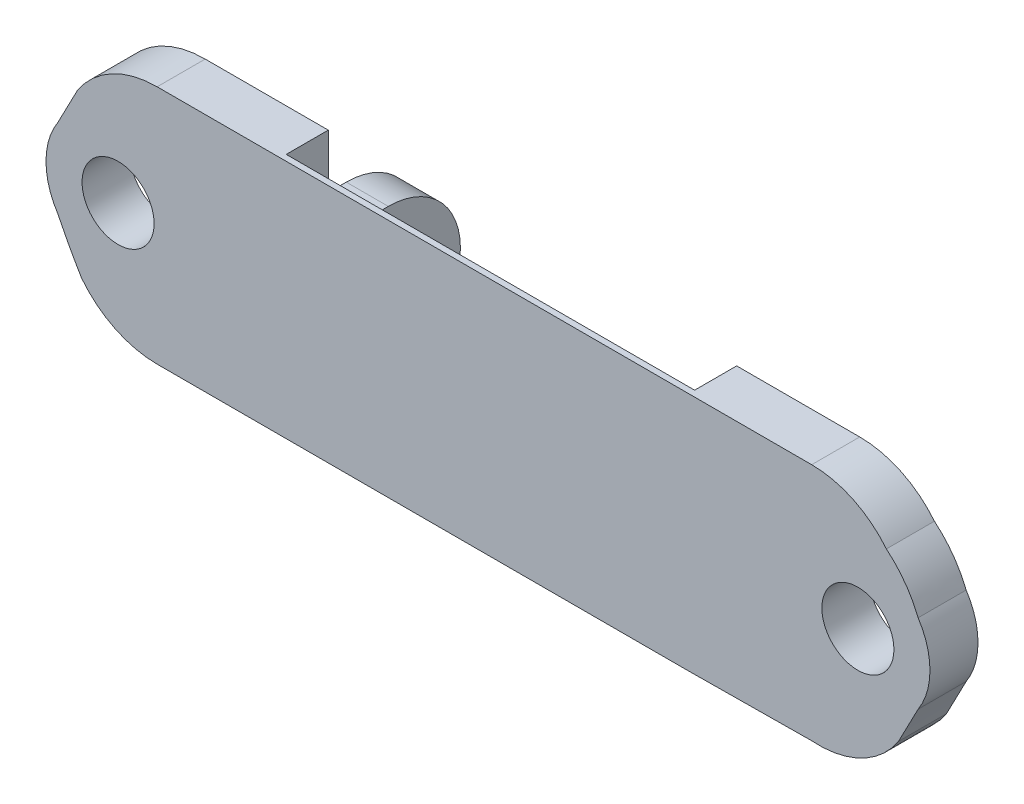
ISO-10303-21;
HEADER;
FILE_DESCRIPTION(('STEP AP214'),'2;1');
FILE_NAME('part.step','',(''),(''),'','','');
FILE_SCHEMA(('AUTOMOTIVE_DESIGN { 1 0 10303 214 1 1 1 1 }'));
ENDSEC;
DATA;
#1=APPLICATION_CONTEXT('core data for automotive mechanical design processes');
#2=APPLICATION_PROTOCOL_DEFINITION('international standard','automotive_design',2000,#1);
#3=PRODUCT_CONTEXT('',#1,'mechanical');
#4=PRODUCT('Part','Part','',(#3));
#5=PRODUCT_RELATED_PRODUCT_CATEGORY('part','',(#4));
#6=PRODUCT_DEFINITION_FORMATION('','',#4);
#7=PRODUCT_DEFINITION_CONTEXT('part definition',#1,'design');
#8=PRODUCT_DEFINITION('design','',#6,#7);
#9=PRODUCT_DEFINITION_SHAPE('','',#8);
#10=(LENGTH_UNIT() NAMED_UNIT(*) SI_UNIT(.MILLI.,.METRE.));
#11=(NAMED_UNIT(*) PLANE_ANGLE_UNIT() SI_UNIT($,.RADIAN.));
#12=(NAMED_UNIT(*) SI_UNIT($,.STERADIAN.) SOLID_ANGLE_UNIT());
#13=UNCERTAINTY_MEASURE_WITH_UNIT(LENGTH_MEASURE(1.E-05),#10,'distance_accuracy_value','');
#14=(GEOMETRIC_REPRESENTATION_CONTEXT(3) GLOBAL_UNCERTAINTY_ASSIGNED_CONTEXT((#13)) GLOBAL_UNIT_ASSIGNED_CONTEXT((#10,
#11,#12)) REPRESENTATION_CONTEXT('',''));
#15=CARTESIAN_POINT('',(0.,0.,0.));
#16=DIRECTION('',(0.,0.,1.));
#17=DIRECTION('',(1.,0.,0.));
#18=AXIS2_PLACEMENT_3D('',#15,#16,#17);
#19=CARTESIAN_POINT('',(-16.9999933862145,0.,4.));
#20=DIRECTION('',(1.,0.,0.));
#21=DIRECTION('',(0.,1.,0.));
#22=AXIS2_PLACEMENT_3D('',#19,#20,#21);
#23=PLANE('',#22);
#24=CARTESIAN_POINT('',(-16.9999933862145,-3.99999931575757,-6.00000102816619));
#25=DIRECTION('',(1.,0.,0.));
#26=DIRECTION('',(0.,0.,-1.));
#27=AXIS2_PLACEMENT_3D('',#24,#25,#26);
#28=CIRCLE('',#27,2.59999897183381);
#29=CARTESIAN_POINT('',(-16.9999933862145,-3.99999931575757,-8.6));
#30=VERTEX_POINT('',#29);
#31=EDGE_CURVE('E483',#30,#30,#28,.T.);
#32=ORIENTED_EDGE('',*,*,#31,.F.);
#33=EDGE_LOOP('',(#32));
#34=FACE_BOUND('',#33,.T.);
#35=DIRECTION('',(0.,-0.992631533391881,-0.121171939474797));
#36=VECTOR('',#35,1.);
#37=CARTESIAN_POINT('',(-16.9999933862145,-0.274222707120713,2.24641206074548));
#38=LINE('',#37,#36);
#39=CARTESIAN_POINT('',(-16.9999933862145,9.99999998281392,3.500601));
#40=VERTEX_POINT('',#39);
#41=CARTESIAN_POINT('',(-16.9999933862145,-2.29281201718889,1.99999999999999));
#42=VERTEX_POINT('',#41);
#43=EDGE_CURVE('E504',#40,#42,#38,.T.);
#44=ORIENTED_EDGE('',*,*,#43,.T.);
#45=DIRECTION('',(0.,-1.,0.));
#46=VECTOR('',#45,1.);
#47=CARTESIAN_POINT('',(-16.9999933862145,0.,1.99999999999999));
#48=LINE('',#47,#46);
#49=CARTESIAN_POINT('',(-16.9999933862145,-10.0000000171888,1.99999999999999));
#50=VERTEX_POINT('',#49);
#51=EDGE_CURVE('E284',#42,#50,#48,.T.);
#52=ORIENTED_EDGE('',*,*,#51,.T.);
#53=DIRECTION('',(0.,0.,-1.));
#54=VECTOR('',#53,1.);
#55=CARTESIAN_POINT('',(-16.9999933862145,-10.0000000171888,4.));
#56=LINE('',#55,#54);
#57=CARTESIAN_POINT('',(-16.9999933862145,-10.0000000171888,-4.99999929856876));
#58=VERTEX_POINT('',#57);
#59=EDGE_CURVE('E523',#50,#58,#56,.T.);
#60=ORIENTED_EDGE('',*,*,#59,.T.);
#61=CARTESIAN_POINT('',(-16.9999933862145,-3.99999931575757,-4.99999929856876));
#62=DIRECTION('',(1.,0.,0.));
#63=DIRECTION('',(0.,0.,-1.));
#64=AXIS2_PLACEMENT_3D('',#61,#62,#63);
#65=CIRCLE('',#64,6.00000070143124);
#66=CARTESIAN_POINT('',(-16.9999933862145,2.00000138567367,-4.99999929856876));
#67=VERTEX_POINT('',#66);
#68=EDGE_CURVE('E418',#58,#67,#65,.T.);
#69=ORIENTED_EDGE('',*,*,#68,.T.);
#70=DIRECTION('',(0.,0.,-1.));
#71=VECTOR('',#70,1.);
#72=CARTESIAN_POINT('',(-16.9999933862145,2.00000138567367,0.));
#73=LINE('',#72,#71);
#74=CARTESIAN_POINT('',(-16.9999933862145,2.00000138567367,0.));
#75=VERTEX_POINT('',#74);
#76=EDGE_CURVE('E413',#75,#67,#73,.T.);
#77=ORIENTED_EDGE('',*,*,#76,.F.);
#78=DIRECTION('',(0.,-1.,0.));
#79=VECTOR('',#78,1.);
#80=CARTESIAN_POINT('',(-16.9999933862145,0.,0.));
#81=LINE('',#80,#79);
#82=CARTESIAN_POINT('',(-16.9999933862145,9.99999998281392,0.));
#83=VERTEX_POINT('',#82);
#84=EDGE_CURVE('E394',#83,#75,#81,.T.);
#85=ORIENTED_EDGE('',*,*,#84,.F.);
#86=DIRECTION('',(0.,0.,-1.));
#87=VECTOR('',#86,1.);
#88=CARTESIAN_POINT('',(-16.9999933862145,9.99999998281392,4.));
#89=LINE('',#88,#87);
#90=EDGE_CURVE('E526',#40,#83,#89,.T.);
#91=ORIENTED_EDGE('',*,*,#90,.F.);
#92=EDGE_LOOP('',(#44,#52,#60,#69,#77,#85,#91));
#93=FACE_BOUND('',#92,.T.);
#94=ADVANCED_FACE('F37',(#34,#93),#23,.T.);
#95=CARTESIAN_POINT('',(0.,0.,0.));
#96=DIRECTION('',(0.,0.,1.));
#97=DIRECTION('',(1.,0.,0.));
#98=AXIS2_PLACEMENT_3D('',#95,#96,#97);
#99=PLANE('',#98);
#100=CARTESIAN_POINT('',(-30.5000467110804,-1.99999999981465E-06,0.));
#101=DIRECTION('',(0.,0.,1.));
#102=DIRECTION('',(1.,0.,0.));
#103=AXIS2_PLACEMENT_3D('',#100,#101,#102);
#104=CIRCLE('',#103,3.00002790263874);
#105=CARTESIAN_POINT('',(-27.5000188084417,-1.99999999981465E-06,0.));
#106=VERTEX_POINT('',#105);
#107=EDGE_CURVE('E364',#106,#106,#104,.T.);
#108=ORIENTED_EDGE('',*,*,#107,.T.);
#109=EDGE_LOOP('',(#108));
#110=FACE_BOUND('',#109,.T.);
#111=DIRECTION('',(1.,0.,0.));
#112=VECTOR('',#111,1.);
#113=CARTESIAN_POINT('',(-20.4999933862145,2.00000138567367,0.));
#114=LINE('',#113,#112);
#115=CARTESIAN_POINT('',(-20.4999933862145,2.00000138567367,0.));
#116=VERTEX_POINT('',#115);
#117=EDGE_CURVE('E371',#116,#75,#114,.T.);
#118=ORIENTED_EDGE('',*,*,#117,.F.);
#119=DIRECTION('',(0.,1.,0.));
#120=VECTOR('',#119,1.);
#121=CARTESIAN_POINT('',(-20.4999933862145,0.,0.));
#122=LINE('',#121,#120);
#123=CARTESIAN_POINT('',(-20.4999933862145,-10.0000000171888,0.));
#124=VERTEX_POINT('',#123);
#125=EDGE_CURVE('E395',#124,#116,#122,.T.);
#126=ORIENTED_EDGE('',*,*,#125,.F.);
#127=DIRECTION('',(1.,0.,0.));
#128=VECTOR('',#127,1.);
#129=CARTESIAN_POINT('',(0.,-10.0000000171888,0.));
#130=LINE('',#129,#128);
#131=CARTESIAN_POINT('',(-27.2459933862145,-10.0000000171888,0.));
#132=VERTEX_POINT('',#131);
#133=EDGE_CURVE('E385',#132,#124,#130,.T.);
#134=ORIENTED_EDGE('',*,*,#133,.F.);
#135=CARTESIAN_POINT('',(-27.2459933862145,-1.99998694505037,0.));
#136=DIRECTION('',(0.,0.,1.));
#137=DIRECTION('',(1.,0.,0.));
#138=AXIS2_PLACEMENT_3D('',#135,#136,#137);
#139=CIRCLE('',#138,8.00001307213843);
#140=CARTESIAN_POINT('',(-33.54048,-6.937562,0.));
#141=VERTEX_POINT('',#140);
#142=EDGE_CURVE('E379',#132,#141,#139,.F.);
#143=ORIENTED_EDGE('',*,*,#142,.T.);
#144=CARTESIAN_POINT('',(-35.515,-3.293894,0.));
#145=CARTESIAN_POINT('',(-34.6044389908926,-5.15695691780324,0.));
#146=CARTESIAN_POINT('',(-33.54048,-6.937562,0.));
#147=B_SPLINE_CURVE_WITH_KNOTS('',2,(#144,#145,#146),.UNSPECIFIED.,.F.,.F.,(3,3),(0.,1.),.UNSPECIFIED.);
#148=CARTESIAN_POINT('',(-35.515,-3.293894,0.));
#149=VERTEX_POINT('',#148);
#150=EDGE_CURVE('E374',#149,#141,#147,.T.);
#151=ORIENTED_EDGE('',*,*,#150,.F.);
#152=CARTESIAN_POINT('',(-30.5000467110804,-1.99999999981465E-06,0.));
#153=DIRECTION('',(0.,0.,1.));
#154=DIRECTION('',(1.,0.,0.));
#155=AXIS2_PLACEMENT_3D('',#152,#153,#154);
#156=CIRCLE('',#155,5.99995674965323);
#157=CARTESIAN_POINT('',(-35.515,3.29389,0.));
#158=VERTEX_POINT('',#157);
#159=EDGE_CURVE('E370',#158,#149,#156,.T.);
#160=ORIENTED_EDGE('',*,*,#159,.F.);
#161=CARTESIAN_POINT('',(-33.8759150000008,6.4362595,0.));
#162=CARTESIAN_POINT('',(-34.671605619201,4.85257254742909,0.));
#163=CARTESIAN_POINT('',(-35.515,3.29389,0.));
#164=B_SPLINE_CURVE_WITH_KNOTS('',2,(#161,#162,#163),.UNSPECIFIED.,.F.,.F.,(3,3),(0.,1.),.UNSPECIFIED.);
#165=CARTESIAN_POINT('',(-33.8759150000008,6.4362595,0.));
#166=VERTEX_POINT('',#165);
#167=EDGE_CURVE('E427',#166,#158,#164,.T.);
#168=ORIENTED_EDGE('',*,*,#167,.F.);
#169=CARTESIAN_POINT('',(-27.2665528840225,2.08928210255105,0.));
#170=DIRECTION('',(0.,0.,1.));
#171=DIRECTION('',(1.,0.,0.));
#172=AXIS2_PLACEMENT_3D('',#169,#170,#171);
#173=CIRCLE('',#172,7.91074459669005);
#174=CARTESIAN_POINT('',(-27.2459933862145,9.99999998281392,0.));
#175=VERTEX_POINT('',#174);
#176=EDGE_CURVE('E633',#175,#166,#173,.T.);
#177=ORIENTED_EDGE('',*,*,#176,.F.);
#178=DIRECTION('',(1.,0.,0.));
#179=VECTOR('',#178,1.);
#180=CARTESIAN_POINT('',(0.,9.99999998281392,0.));
#181=LINE('',#180,#179);
#182=EDGE_CURVE('E642',#175,#83,#181,.T.);
#183=ORIENTED_EDGE('',*,*,#182,.T.);
#184=ORIENTED_EDGE('',*,*,#84,.T.);
#185=EDGE_LOOP('',(#118,#126,#134,#143,#151,#160,#168,#177,#183,#184));
#186=FACE_BOUND('',#185,.T.);
#187=ADVANCED_FACE('F344',(#110,#186),#99,.F.);
#188=CARTESIAN_POINT('',(-30.5000467110804,-1.99999999981465E-06,4.));
#189=DIRECTION('',(0.,0.,-1.));
#190=DIRECTION('',(-1.,0.,0.));
#191=AXIS2_PLACEMENT_3D('',#188,#189,#190);
#192=CYLINDRICAL_SURFACE('',#191,5.99995674965323);
#193=ORIENTED_EDGE('',*,*,#159,.T.);
#194=DIRECTION('',(0.,0.,-1.));
#195=VECTOR('',#194,1.);
#196=CARTESIAN_POINT('',(-35.515,-3.293894,4.));
#197=LINE('',#196,#195);
#198=CARTESIAN_POINT('',(-35.515,-3.293894,4.));
#199=VERTEX_POINT('',#198);
#200=EDGE_CURVE('E11',#199,#149,#197,.T.);
#201=ORIENTED_EDGE('',*,*,#200,.F.);
#202=CARTESIAN_POINT('',(-30.5000467110804,-1.99999999981465E-06,4.));
#203=DIRECTION('',(0.,0.,1.));
#204=DIRECTION('',(1.,0.,0.));
#205=AXIS2_PLACEMENT_3D('',#202,#203,#204);
#206=CIRCLE('',#205,5.99995674965323);
#207=CARTESIAN_POINT('',(-35.515,3.29389,4.));
#208=VERTEX_POINT('',#207);
#209=EDGE_CURVE('E426',#208,#199,#206,.T.);
#210=ORIENTED_EDGE('',*,*,#209,.F.);
#211=DIRECTION('',(0.,0.,-1.));
#212=VECTOR('',#211,1.);
#213=CARTESIAN_POINT('',(-35.515,3.29389,4.));
#214=LINE('',#213,#212);
#215=EDGE_CURVE('E361',#208,#158,#214,.T.);
#216=ORIENTED_EDGE('',*,*,#215,.T.);
#217=EDGE_LOOP('',(#193,#201,#210,#216));
#218=FACE_BOUND('',#217,.T.);
#219=ADVANCED_FACE('F347',(#218),#192,.T.);
#220=CARTESIAN_POINT('',(-35.515,-3.293894,4.));
#221=CARTESIAN_POINT('',(-34.6044389908926,-5.15695691780324,4.));
#222=CARTESIAN_POINT('',(-33.54048,-6.937562,4.));
#223=B_SPLINE_CURVE_WITH_KNOTS('',2,(#220,#221,#222),.UNSPECIFIED.,.F.,.F.,(3,3),(0.,1.),.UNSPECIFIED.);
#224=DIRECTION('',(0.,0.,-1.));
#225=VECTOR('',#224,1.);
#226=SURFACE_OF_LINEAR_EXTRUSION('',#223,#225);
#227=ORIENTED_EDGE('',*,*,#150,.T.);
#228=DIRECTION('',(0.,0.,-1.));
#229=VECTOR('',#228,1.);
#230=CARTESIAN_POINT('',(-33.54048,-6.937562,4.));
#231=LINE('',#230,#229);
#232=CARTESIAN_POINT('',(-33.54048,-6.937562,4.));
#233=VERTEX_POINT('',#232);
#234=EDGE_CURVE('E47',#233,#141,#231,.T.);
#235=ORIENTED_EDGE('',*,*,#234,.F.);
#236=EDGE_CURVE('E430',#199,#233,#223,.T.);
#237=ORIENTED_EDGE('',*,*,#236,.F.);
#238=ORIENTED_EDGE('',*,*,#200,.T.);
#239=EDGE_LOOP('',(#227,#235,#237,#238));
#240=FACE_BOUND('',#239,.T.);
#241=ADVANCED_FACE('F441',(#240),#226,.F.);
#242=CARTESIAN_POINT('',(-27.2459933862145,-1.99998694505037,4.));
#243=DIRECTION('',(0.,0.,-1.));
#244=DIRECTION('',(-1.,0.,0.));
#245=AXIS2_PLACEMENT_3D('',#242,#243,#244);
#246=CYLINDRICAL_SURFACE('',#245,8.00001307213843);
#247=ORIENTED_EDGE('',*,*,#142,.F.);
#248=DIRECTION('',(0.,0.,-1.));
#249=VECTOR('',#248,1.);
#250=CARTESIAN_POINT('',(-27.2459933862145,-10.0000000171888,4.));
#251=LINE('',#250,#249);
#252=CARTESIAN_POINT('',(-27.2459933862145,-10.0000000171888,4.));
#253=VERTEX_POINT('',#252);
#254=EDGE_CURVE('E472',#253,#132,#251,.T.);
#255=ORIENTED_EDGE('',*,*,#254,.F.);
#256=CARTESIAN_POINT('',(-27.2459933862145,-1.99998694505037,4.));
#257=DIRECTION('',(0.,0.,1.));
#258=DIRECTION('',(1.,0.,0.));
#259=AXIS2_PLACEMENT_3D('',#256,#257,#258);
#260=CIRCLE('',#259,8.00001307213843);
#261=EDGE_CURVE('E435',#253,#233,#260,.F.);
#262=ORIENTED_EDGE('',*,*,#261,.T.);
#263=ORIENTED_EDGE('',*,*,#234,.T.);
#264=EDGE_LOOP('',(#247,#255,#262,#263));
#265=FACE_BOUND('',#264,.T.);
#266=ADVANCED_FACE('F444',(#265),#246,.T.);
#267=CARTESIAN_POINT('',(0.,-10.0000000171888,4.));
#268=DIRECTION('',(0.,1.,0.));
#269=DIRECTION('',(0.,0.,1.));
#270=AXIS2_PLACEMENT_3D('',#267,#268,#269);
#271=PLANE('',#270);
#272=ORIENTED_EDGE('',*,*,#133,.T.);
#273=DIRECTION('',(0.,0.,1.));
#274=VECTOR('',#273,1.);
#275=CARTESIAN_POINT('',(-20.4999933862145,-10.0000000171888,0.));
#276=LINE('',#275,#274);
#277=CARTESIAN_POINT('',(-20.4999933862145,-10.0000000171888,-4.99999929856876));
#278=VERTEX_POINT('',#277);
#279=EDGE_CURVE('E402',#278,#124,#276,.T.);
#280=ORIENTED_EDGE('',*,*,#279,.F.);
#281=DIRECTION('',(1.,0.,0.));
#282=VECTOR('',#281,1.);
#283=CARTESIAN_POINT('',(-20.4999933862145,-10.0000000171888,-4.99999929856876));
#284=LINE('',#283,#282);
#285=EDGE_CURVE('E398',#278,#58,#284,.T.);
#286=ORIENTED_EDGE('',*,*,#285,.T.);
#287=ORIENTED_EDGE('',*,*,#59,.F.);
#288=DIRECTION('',(-1.,0.,0.));
#289=VECTOR('',#288,1.);
#290=CARTESIAN_POINT('',(17.0000066137855,-10.0000000171888,1.99999999999999));
#291=LINE('',#290,#289);
#292=CARTESIAN_POINT('',(17.0000066137855,-10.0000000171888,1.99999999999999));
#293=VERTEX_POINT('',#292);
#294=EDGE_CURVE('E494',#293,#50,#291,.T.);
#295=ORIENTED_EDGE('',*,*,#294,.F.);
#296=DIRECTION('',(0.,0.,-1.));
#297=VECTOR('',#296,1.);
#298=CARTESIAN_POINT('',(17.0000066137855,-10.0000000171888,0.));
#299=LINE('',#298,#297);
#300=CARTESIAN_POINT('',(17.0000066137855,-10.0000000171888,4.));
#301=VERTEX_POINT('',#300);
#302=EDGE_CURVE('E509',#301,#293,#299,.T.);
#303=ORIENTED_EDGE('',*,*,#302,.F.);
#304=DIRECTION('',(1.,0.,0.));
#305=VECTOR('',#304,1.);
#306=CARTESIAN_POINT('',(0.,-10.0000000171888,4.));
#307=LINE('',#306,#305);
#308=EDGE_CURVE('E620',#253,#301,#307,.T.);
#309=ORIENTED_EDGE('',*,*,#308,.F.);
#310=ORIENTED_EDGE('',*,*,#254,.T.);
#311=EDGE_LOOP('',(#272,#280,#286,#287,#295,#303,#309,#310));
#312=FACE_BOUND('',#311,.T.);
#313=ADVANCED_FACE('F459',(#312),#271,.F.);
#314=CARTESIAN_POINT('',(0.,9.99999998281392,4.));
#315=DIRECTION('',(0.,1.,0.));
#316=DIRECTION('',(0.,0.,1.));
#317=AXIS2_PLACEMENT_3D('',#314,#315,#316);
#318=PLANE('',#317);
#319=ORIENTED_EDGE('',*,*,#182,.F.);
#320=DIRECTION('',(0.,0.,-1.));
#321=VECTOR('',#320,1.);
#322=CARTESIAN_POINT('',(-27.2459933862145,9.99999998281392,4.));
#323=LINE('',#322,#321);
#324=CARTESIAN_POINT('',(-27.2459933862145,9.99999998281392,4.));
#325=VERTEX_POINT('',#324);
#326=EDGE_CURVE('E635',#325,#175,#323,.T.);
#327=ORIENTED_EDGE('',*,*,#326,.F.);
#328=DIRECTION('',(1.,0.,0.));
#329=VECTOR('',#328,1.);
#330=CARTESIAN_POINT('',(0.,9.99999998281392,4.));
#331=LINE('',#330,#329);
#332=CARTESIAN_POINT('',(27.2460066137855,9.99999998281392,4.));
#333=VERTEX_POINT('',#332);
#334=EDGE_CURVE('E621',#325,#333,#331,.T.);
#335=ORIENTED_EDGE('',*,*,#334,.T.);
#336=DIRECTION('',(0.,0.,1.));
#337=VECTOR('',#336,1.);
#338=CARTESIAN_POINT('',(27.2460066137855,9.99999998281392,-28.3493348544401));
#339=LINE('',#338,#337);
#340=CARTESIAN_POINT('',(27.2460066137855,9.99999998281392,0.));
#341=VERTEX_POINT('',#340);
#342=EDGE_CURVE('E559',#341,#333,#339,.T.);
#343=ORIENTED_EDGE('',*,*,#342,.F.);
#344=DIRECTION('',(-1.,0.,0.));
#345=VECTOR('',#344,1.);
#346=CARTESIAN_POINT('',(0.,9.99999998281393,0.));
#347=LINE('',#346,#345);
#348=CARTESIAN_POINT('',(17.0000066137855,9.99999998281392,0.));
#349=VERTEX_POINT('',#348);
#350=EDGE_CURVE('E259',#341,#349,#347,.T.);
#351=ORIENTED_EDGE('',*,*,#350,.T.);
#352=DIRECTION('',(0.,0.,1.));
#353=VECTOR('',#352,1.);
#354=CARTESIAN_POINT('',(17.0000066137855,9.99999998281392,-28.3493348544401));
#355=LINE('',#354,#353);
#356=CARTESIAN_POINT('',(17.0000066137855,9.99999998281392,3.500601));
#357=VERTEX_POINT('',#356);
#358=EDGE_CURVE('E555',#349,#357,#355,.T.);
#359=ORIENTED_EDGE('',*,*,#358,.T.);
#360=DIRECTION('',(-1.,0.,0.));
#361=VECTOR('',#360,1.);
#362=CARTESIAN_POINT('',(17.0000066137855,9.99999998281392,3.500601));
#363=LINE('',#362,#361);
#364=EDGE_CURVE('E489',#357,#40,#363,.T.);
#365=ORIENTED_EDGE('',*,*,#364,.T.);
#366=ORIENTED_EDGE('',*,*,#90,.T.);
#367=EDGE_LOOP('',(#319,#327,#335,#343,#351,#359,#365,#366));
#368=FACE_BOUND('',#367,.T.);
#369=ADVANCED_FACE('F458',(#368),#318,.T.);
#370=CARTESIAN_POINT('',(-27.2665528840225,2.08928210255105,4.));
#371=DIRECTION('',(0.,0.,-1.));
#372=DIRECTION('',(-1.,0.,0.));
#373=AXIS2_PLACEMENT_3D('',#370,#371,#372);
#374=CYLINDRICAL_SURFACE('',#373,7.91074459669005);
#375=ORIENTED_EDGE('',*,*,#176,.T.);
#376=DIRECTION('',(0.,0.,-1.));
#377=VECTOR('',#376,1.);
#378=CARTESIAN_POINT('',(-33.8759150000008,6.4362595,4.));
#379=LINE('',#378,#377);
#380=CARTESIAN_POINT('',(-33.8759150000008,6.4362595,4.));
#381=VERTEX_POINT('',#380);
#382=EDGE_CURVE('E631',#381,#166,#379,.T.);
#383=ORIENTED_EDGE('',*,*,#382,.F.);
#384=CARTESIAN_POINT('',(-27.2665528840225,2.08928210255105,4.));
#385=DIRECTION('',(0.,0.,1.));
#386=DIRECTION('',(1.,0.,0.));
#387=AXIS2_PLACEMENT_3D('',#384,#385,#386);
#388=CIRCLE('',#387,7.91074459669005);
#389=EDGE_CURVE('E362',#325,#381,#388,.T.);
#390=ORIENTED_EDGE('',*,*,#389,.F.);
#391=ORIENTED_EDGE('',*,*,#326,.T.);
#392=EDGE_LOOP('',(#375,#383,#390,#391));
#393=FACE_BOUND('',#392,.T.);
#394=ADVANCED_FACE('F353',(#393),#374,.T.);
#395=CARTESIAN_POINT('',(-30.5000467110804,-1.99999999981465E-06,4.));
#396=DIRECTION('',(0.,0.,-1.));
#397=DIRECTION('',(-1.,0.,0.));
#398=AXIS2_PLACEMENT_3D('',#395,#396,#397);
#399=CYLINDRICAL_SURFACE('',#398,3.00002790263874);
#400=CARTESIAN_POINT('',(-30.5000467110804,-1.99999999981465E-06,4.));
#401=DIRECTION('',(0.,0.,1.));
#402=DIRECTION('',(1.,0.,0.));
#403=AXIS2_PLACEMENT_3D('',#400,#401,#402);
#404=CIRCLE('',#403,3.00002790263874);
#405=CARTESIAN_POINT('',(-27.5000188084417,-1.99999999981465E-06,4.));
#406=VERTEX_POINT('',#405);
#407=EDGE_CURVE('E423',#406,#406,#404,.T.);
#408=ORIENTED_EDGE('',*,*,#407,.T.);
#409=EDGE_LOOP('',(#408));
#410=FACE_BOUND('',#409,.T.);
#411=ORIENTED_EDGE('',*,*,#107,.F.);
#412=EDGE_LOOP('',(#411));
#413=FACE_BOUND('',#412,.T.);
#414=ADVANCED_FACE('F39',(#410,#413),#399,.F.);
#415=CARTESIAN_POINT('',(-33.8759150000008,6.4362595,4.));
#416=CARTESIAN_POINT('',(-34.671605619201,4.85257254742909,4.));
#417=CARTESIAN_POINT('',(-35.515,3.29389,4.));
#418=B_SPLINE_CURVE_WITH_KNOTS('',2,(#415,#416,#417),.UNSPECIFIED.,.F.,.F.,(3,3),(0.,1.),.UNSPECIFIED.);
#419=DIRECTION('',(0.,0.,-1.));
#420=VECTOR('',#419,1.);
#421=SURFACE_OF_LINEAR_EXTRUSION('',#418,#420);
#422=ORIENTED_EDGE('',*,*,#167,.T.);
#423=ORIENTED_EDGE('',*,*,#215,.F.);
#424=EDGE_CURVE('E355',#381,#208,#418,.T.);
#425=ORIENTED_EDGE('',*,*,#424,.F.);
#426=ORIENTED_EDGE('',*,*,#382,.T.);
#427=EDGE_LOOP('',(#422,#423,#425,#426));
#428=FACE_BOUND('',#427,.T.);
#429=ADVANCED_FACE('F342',(#428),#421,.F.);
#430=CARTESIAN_POINT('',(0.,0.,4.));
#431=DIRECTION('',(0.,0.,1.));
#432=DIRECTION('',(1.,0.,0.));
#433=AXIS2_PLACEMENT_3D('',#430,#431,#432);
#434=PLANE('',#433);
#435=ORIENTED_EDGE('',*,*,#407,.F.);
#436=EDGE_LOOP('',(#435));
#437=FACE_BOUND('',#436,.T.);
#438=ORIENTED_EDGE('',*,*,#209,.T.);
#439=ORIENTED_EDGE('',*,*,#236,.T.);
#440=ORIENTED_EDGE('',*,*,#261,.F.);
#441=ORIENTED_EDGE('',*,*,#308,.T.);
#442=DIRECTION('',(-0.999956948472392,-0.00927907332559516,0.));
#443=VECTOR('',#442,1.);
#444=CARTESIAN_POINT('',(0.0942504596323714,-10.156876521941,4.));
#445=LINE('',#444,#443);
#446=CARTESIAN_POINT('',(27.2460066137855,-9.90492253866407,4.));
#447=VERTEX_POINT('',#446);
#448=EDGE_CURVE('E585',#447,#301,#445,.T.);
#449=ORIENTED_EDGE('',*,*,#448,.F.);
#450=CARTESIAN_POINT('',(27.843667233727,-2.01678702655273,4.));
#451=DIRECTION('',(0.,0.,1.));
#452=DIRECTION('',(1.,0.,0.));
#453=AXIS2_PLACEMENT_3D('',#450,#451,#452);
#454=CIRCLE('',#453,7.91074459669005);
#455=CARTESIAN_POINT('',(34.4678266410245,-6.34118203866401,4.));
#456=VERTEX_POINT('',#455);
#457=EDGE_CURVE('E579',#447,#456,#454,.T.);
#458=ORIENTED_EDGE('',*,*,#457,.T.);
#459=CARTESIAN_POINT('',(34.4678266410245,-6.34118203866401,4.));
#460=CARTESIAN_POINT('',(35.2635172602257,-4.7574950860934,4.));
#461=CARTESIAN_POINT('',(36.1069116410244,-3.19881253866399,4.));
#462=B_SPLINE_CURVE_WITH_KNOTS('',2,(#459,#460,#461),.UNSPECIFIED.,.F.,.F.,(3,3),(0.,1.),.UNSPECIFIED.);
#463=CARTESIAN_POINT('',(36.1069116410244,-3.19881253866399,4.));
#464=VERTEX_POINT('',#463);
#465=EDGE_CURVE('E574',#456,#464,#462,.T.);
#466=ORIENTED_EDGE('',*,*,#465,.T.);
#467=CARTESIAN_POINT('',(31.0919583521048,0.0950794613359769,4.));
#468=DIRECTION('',(0.,0.,1.));
#469=DIRECTION('',(1.,0.,0.));
#470=AXIS2_PLACEMENT_3D('',#467,#468,#469);
#471=CIRCLE('',#470,5.99995674965323);
#472=CARTESIAN_POINT('',(36.1069116410244,3.38897146133602,4.));
#473=VERTEX_POINT('',#472);
#474=EDGE_CURVE('E605',#464,#473,#471,.T.);
#475=ORIENTED_EDGE('',*,*,#474,.T.);
#476=CARTESIAN_POINT('',(36.1069116410244,3.38897146133602,4.));
#477=CARTESIAN_POINT('',(35.2558734720784,5.53098412197611,4.));
#478=CARTESIAN_POINT('',(33.4647377913422,7.03263946133603,4.));
#479=B_SPLINE_CURVE_WITH_KNOTS('',2,(#476,#477,#478),.UNSPECIFIED.,.F.,.F.,(3,3),(0.,1.),.UNSPECIFIED.);
#480=CARTESIAN_POINT('',(33.4647377913422,7.03263946133603,4.));
#481=VERTEX_POINT('',#480);
#482=EDGE_CURVE('E607',#473,#481,#479,.T.);
#483=ORIENTED_EDGE('',*,*,#482,.T.);
#484=CARTESIAN_POINT('',(27.2460066137855,1.99998691067549,4.));
#485=DIRECTION('',(0.,0.,1.));
#486=DIRECTION('',(1.,0.,0.));
#487=AXIS2_PLACEMENT_3D('',#484,#485,#486);
#488=CIRCLE('',#487,8.00001307213843);
#489=EDGE_CURVE('E609',#333,#481,#488,.F.);
#490=ORIENTED_EDGE('',*,*,#489,.F.);
#491=ORIENTED_EDGE('',*,*,#334,.F.);
#492=ORIENTED_EDGE('',*,*,#389,.T.);
#493=ORIENTED_EDGE('',*,*,#424,.T.);
#494=EDGE_LOOP('',(#438,#439,#440,#441,#449,#458,#466,#475,#483,#490,#491,#492,#493));
#495=FACE_BOUND('',#494,.T.);
#496=CARTESIAN_POINT('',(31.0919583521048,0.0950794613359769,4.));
#497=DIRECTION('',(0.,0.,1.));
#498=DIRECTION('',(1.,0.,0.));
#499=AXIS2_PLACEMENT_3D('',#496,#497,#498);
#500=CIRCLE('',#499,3.00002790263876);
#501=CARTESIAN_POINT('',(34.0919862547436,0.0950794613359769,4.));
#502=VERTEX_POINT('',#501);
#503=EDGE_CURVE('E280',#502,#502,#500,.T.);
#504=ORIENTED_EDGE('',*,*,#503,.F.);
#505=EDGE_LOOP('',(#504));
#506=FACE_BOUND('',#505,.T.);
#507=ADVANCED_FACE('F332',(#437,#495,#506),#434,.T.);
#508=CARTESIAN_POINT('',(-20.4999933862145,2.00000138567367,0.));
#509=DIRECTION('',(0.,-1.,0.));
#510=DIRECTION('',(0.,0.,-1.));
#511=AXIS2_PLACEMENT_3D('',#508,#509,#510);
#512=PLANE('',#511);
#513=ORIENTED_EDGE('',*,*,#76,.T.);
#514=DIRECTION('',(1.,0.,0.));
#515=VECTOR('',#514,1.);
#516=CARTESIAN_POINT('',(-20.4999933862145,2.00000138567367,-4.99999929856876));
#517=LINE('',#516,#515);
#518=CARTESIAN_POINT('',(-20.4999933862145,2.00000138567367,-4.99999929856876));
#519=VERTEX_POINT('',#518);
#520=EDGE_CURVE('E412',#519,#67,#517,.T.);
#521=ORIENTED_EDGE('',*,*,#520,.F.);
#522=DIRECTION('',(0.,0.,-1.));
#523=VECTOR('',#522,1.);
#524=CARTESIAN_POINT('',(-20.4999933862145,2.00000138567367,0.));
#525=LINE('',#524,#523);
#526=EDGE_CURVE('E399',#116,#519,#525,.T.);
#527=ORIENTED_EDGE('',*,*,#526,.F.);
#528=ORIENTED_EDGE('',*,*,#117,.T.);
#529=EDGE_LOOP('',(#513,#521,#527,#528));
#530=FACE_BOUND('',#529,.T.);
#531=ADVANCED_FACE('F328',(#530),#512,.F.);
#532=CARTESIAN_POINT('',(-20.4999933862145,-3.99999931575757,-6.00000102816619));
#533=DIRECTION('',(1.,0.,0.));
#534=DIRECTION('',(0.,0.,-1.));
#535=AXIS2_PLACEMENT_3D('',#532,#533,#534);
#536=CYLINDRICAL_SURFACE('',#535,2.59999897183381);
#537=CARTESIAN_POINT('',(-20.4999933862145,-3.99999931575757,-6.00000102816619));
#538=DIRECTION('',(1.,0.,0.));
#539=DIRECTION('',(0.,0.,-1.));
#540=AXIS2_PLACEMENT_3D('',#537,#538,#539);
#541=CIRCLE('',#540,2.59999897183381);
#542=CARTESIAN_POINT('',(-20.4999933862145,-3.99999931575757,-8.6));
#543=VERTEX_POINT('',#542);
#544=EDGE_CURVE('E406',#543,#543,#541,.T.);
#545=ORIENTED_EDGE('',*,*,#544,.F.);
#546=EDGE_LOOP('',(#545));
#547=FACE_BOUND('',#546,.T.);
#548=ORIENTED_EDGE('',*,*,#31,.T.);
#549=EDGE_LOOP('',(#548));
#550=FACE_BOUND('',#549,.T.);
#551=ADVANCED_FACE('F331',(#547,#550),#536,.F.);
#552=CARTESIAN_POINT('',(-20.4999933862145,-3.99999931575757,-4.99999929856876));
#553=DIRECTION('',(1.,0.,0.));
#554=DIRECTION('',(0.,0.,-1.));
#555=AXIS2_PLACEMENT_3D('',#552,#553,#554);
#556=CYLINDRICAL_SURFACE('',#555,6.00000070143124);
#557=ORIENTED_EDGE('',*,*,#68,.F.);
#558=ORIENTED_EDGE('',*,*,#285,.F.);
#559=CARTESIAN_POINT('',(-20.4999933862145,-3.99999931575757,-4.99999929856876));
#560=DIRECTION('',(1.,0.,0.));
#561=DIRECTION('',(0.,0.,-1.));
#562=AXIS2_PLACEMENT_3D('',#559,#560,#561);
#563=CIRCLE('',#562,6.00000070143124);
#564=EDGE_CURVE('E405',#278,#519,#563,.T.);
#565=ORIENTED_EDGE('',*,*,#564,.T.);
#566=ORIENTED_EDGE('',*,*,#520,.T.);
#567=EDGE_LOOP('',(#557,#558,#565,#566));
#568=FACE_BOUND('',#567,.T.);
#569=ADVANCED_FACE('F326',(#568),#556,.T.);
#570=CARTESIAN_POINT('',(-20.4999933862145,0.,0.));
#571=DIRECTION('',(1.,0.,0.));
#572=DIRECTION('',(0.,0.,-1.));
#573=AXIS2_PLACEMENT_3D('',#570,#571,#572);
#574=PLANE('',#573);
#575=ORIENTED_EDGE('',*,*,#544,.T.);
#576=EDGE_LOOP('',(#575));
#577=FACE_BOUND('',#576,.T.);
#578=ORIENTED_EDGE('',*,*,#279,.T.);
#579=ORIENTED_EDGE('',*,*,#125,.T.);
#580=ORIENTED_EDGE('',*,*,#526,.T.);
#581=ORIENTED_EDGE('',*,*,#564,.F.);
#582=EDGE_LOOP('',(#578,#579,#580,#581));
#583=FACE_BOUND('',#582,.T.);
#584=ADVANCED_FACE('F322',(#577,#583),#574,.F.);
#585=CARTESIAN_POINT('',(17.0000066137855,0.,1.99999999999999));
#586=DIRECTION('',(0.,0.,-1.));
#587=DIRECTION('',(0.,1.,0.));
#588=AXIS2_PLACEMENT_3D('',#585,#586,#587);
#589=PLANE('',#588);
#590=ORIENTED_EDGE('',*,*,#51,.F.);
#591=DIRECTION('',(-1.,0.,0.));
#592=VECTOR('',#591,1.);
#593=CARTESIAN_POINT('',(17.0000066137855,-2.29281201718889,1.99999999999999));
#594=LINE('',#593,#592);
#595=CARTESIAN_POINT('',(17.0000066137855,-2.29281201718889,1.99999999999999));
#596=VERTEX_POINT('',#595);
#597=EDGE_CURVE('E485',#596,#42,#594,.T.);
#598=ORIENTED_EDGE('',*,*,#597,.F.);
#599=DIRECTION('',(0.,-1.,0.));
#600=VECTOR('',#599,1.);
#601=CARTESIAN_POINT('',(17.0000066137855,0.,1.99999999999999));
#602=LINE('',#601,#600);
#603=EDGE_CURVE('E41',#596,#293,#602,.T.);
#604=ORIENTED_EDGE('',*,*,#603,.T.);
#605=ORIENTED_EDGE('',*,*,#294,.T.);
#606=EDGE_LOOP('',(#590,#598,#604,#605));
#607=FACE_BOUND('',#606,.T.);
#608=ADVANCED_FACE('F318',(#607),#589,.T.);
#609=CARTESIAN_POINT('',(17.0000066137855,-0.274222707120713,2.24641206074548));
#610=DIRECTION('',(0.,0.121171939474797,-0.992631533391881));
#611=DIRECTION('',(0.,0.992631533391881,0.121171939474797));
#612=AXIS2_PLACEMENT_3D('',#609,#610,#611);
#613=PLANE('',#612);
#614=ORIENTED_EDGE('',*,*,#43,.F.);
#615=ORIENTED_EDGE('',*,*,#364,.F.);
#616=DIRECTION('',(0.,-0.992631533391881,-0.121171939474797));
#617=VECTOR('',#616,1.);
#618=CARTESIAN_POINT('',(17.0000066137855,-0.274222707120713,2.24641206074548));
#619=LINE('',#618,#617);
#620=EDGE_CURVE('E507',#357,#596,#619,.T.);
#621=ORIENTED_EDGE('',*,*,#620,.T.);
#622=ORIENTED_EDGE('',*,*,#597,.T.);
#623=EDGE_LOOP('',(#614,#615,#621,#622));
#624=FACE_BOUND('',#623,.T.);
#625=ADVANCED_FACE('F314',(#624),#613,.T.);
#626=CARTESIAN_POINT('',(31.0919583521048,0.0950794613359769,-28.3493348544401));
#627=DIRECTION('',(0.,0.,1.));
#628=DIRECTION('',(1.,0.,0.));
#629=AXIS2_PLACEMENT_3D('',#626,#627,#628);
#630=CYLINDRICAL_SURFACE('',#629,3.00002790263876);
#631=ORIENTED_EDGE('',*,*,#503,.T.);
#632=EDGE_LOOP('',(#631));
#633=FACE_BOUND('',#632,.T.);
#634=CARTESIAN_POINT('',(31.0919583521048,0.0950794613359769,0.));
#635=DIRECTION('',(0.,0.,-1.));
#636=DIRECTION('',(0.,1.,0.));
#637=AXIS2_PLACEMENT_3D('',#634,#635,#636);
#638=CIRCLE('',#637,3.00002790263876);
#639=CARTESIAN_POINT('',(31.0919583521048,3.09510736397474,0.));
#640=VERTEX_POINT('',#639);
#641=EDGE_CURVE('E281',#640,#640,#638,.F.);
#642=ORIENTED_EDGE('',*,*,#641,.F.);
#643=EDGE_LOOP('',(#642));
#644=FACE_BOUND('',#643,.T.);
#645=ADVANCED_FACE('F303',(#633,#644),#630,.F.);
#646=CARTESIAN_POINT('',(36.1069116410244,3.38897146133602,-28.3493348544401));
#647=CARTESIAN_POINT('',(35.2558734720784,5.53098412197611,-28.3493348544401));
#648=CARTESIAN_POINT('',(33.4647377913422,7.03263946133603,-28.3493348544401));
#649=B_SPLINE_CURVE_WITH_KNOTS('',2,(#646,#647,#648),.UNSPECIFIED.,.F.,.F.,(3,3),(0.,1.),.UNSPECIFIED.);
#650=DIRECTION('',(0.,0.,1.));
#651=VECTOR('',#650,1.);
#652=SURFACE_OF_LINEAR_EXTRUSION('',#649,#651);
#653=DIRECTION('',(0.,0.,1.));
#654=VECTOR('',#653,1.);
#655=CARTESIAN_POINT('',(36.1069116410244,3.38897146133602,-28.3493348544401));
#656=LINE('',#655,#654);
#657=CARTESIAN_POINT('',(36.1069116410244,3.38897146133602,0.));
#658=VERTEX_POINT('',#657);
#659=EDGE_CURVE('E573',#658,#473,#656,.T.);
#660=ORIENTED_EDGE('',*,*,#659,.F.);
#661=CARTESIAN_POINT('',(36.1069116410244,3.38897146133602,0.));
#662=CARTESIAN_POINT('',(35.2558734720784,5.53098412197611,0.));
#663=CARTESIAN_POINT('',(33.4647377913422,7.03263946133603,0.));
#664=B_SPLINE_CURVE_WITH_KNOTS('',2,(#661,#662,#663),.UNSPECIFIED.,.F.,.F.,(3,3),(0.,1.),.UNSPECIFIED.);
#665=CARTESIAN_POINT('',(33.4647377913422,7.03263946133603,0.));
#666=VERTEX_POINT('',#665);
#667=EDGE_CURVE('E285',#658,#666,#664,.T.);
#668=ORIENTED_EDGE('',*,*,#667,.T.);
#669=DIRECTION('',(0.,0.,1.));
#670=VECTOR('',#669,1.);
#671=CARTESIAN_POINT('',(33.4647377913422,7.03263946133603,-28.3493348544401));
#672=LINE('',#671,#670);
#673=EDGE_CURVE('E572',#666,#481,#672,.T.);
#674=ORIENTED_EDGE('',*,*,#673,.T.);
#675=ORIENTED_EDGE('',*,*,#482,.F.);
#676=EDGE_LOOP('',(#660,#668,#674,#675));
#677=FACE_BOUND('',#676,.T.);
#678=ADVANCED_FACE('F298',(#677),#652,.T.);
#679=CARTESIAN_POINT('',(27.2460066137855,1.99998691067549,-28.3493348544401));
#680=DIRECTION('',(0.,0.,1.));
#681=DIRECTION('',(1.,0.,0.));
#682=AXIS2_PLACEMENT_3D('',#679,#680,#681);
#683=CYLINDRICAL_SURFACE('',#682,8.00001307213843);
#684=CARTESIAN_POINT('',(27.2460066137855,1.99998691067549,0.));
#685=DIRECTION('',(0.,0.,-1.));
#686=DIRECTION('',(0.,1.,0.));
#687=AXIS2_PLACEMENT_3D('',#684,#685,#686);
#688=CIRCLE('',#687,8.00001307213843);
#689=EDGE_CURVE('E220',#341,#666,#688,.T.);
#690=ORIENTED_EDGE('',*,*,#689,.F.);
#691=ORIENTED_EDGE('',*,*,#342,.T.);
#692=ORIENTED_EDGE('',*,*,#489,.T.);
#693=ORIENTED_EDGE('',*,*,#673,.F.);
#694=EDGE_LOOP('',(#690,#691,#692,#693));
#695=FACE_BOUND('',#694,.T.);
#696=ADVANCED_FACE('F302',(#695),#683,.T.);
#697=CARTESIAN_POINT('',(17.0000066137855,0.,-28.3493348544401));
#698=DIRECTION('',(1.,0.,0.));
#699=DIRECTION('',(0.,0.,-1.));
#700=AXIS2_PLACEMENT_3D('',#697,#698,#699);
#701=PLANE('',#700);
#702=ORIENTED_EDGE('',*,*,#603,.F.);
#703=ORIENTED_EDGE('',*,*,#620,.F.);
#704=ORIENTED_EDGE('',*,*,#358,.F.);
#705=DIRECTION('',(0.,1.,0.));
#706=VECTOR('',#705,1.);
#707=CARTESIAN_POINT('',(17.0000066137855,0.,0.));
#708=LINE('',#707,#706);
#709=CARTESIAN_POINT('',(17.0000066137855,1.98580142953808,0.));
#710=VERTEX_POINT('',#709);
#711=EDGE_CURVE('E262',#710,#349,#708,.T.);
#712=ORIENTED_EDGE('',*,*,#711,.F.);
#713=DIRECTION('',(0.,0.,-1.));
#714=VECTOR('',#713,1.);
#715=CARTESIAN_POINT('',(17.0000066137855,1.98580142953808,0.));
#716=LINE('',#715,#714);
#717=CARTESIAN_POINT('',(17.0000066137855,1.98580142953808,-4.99999929856876));
#718=VERTEX_POINT('',#717);
#719=EDGE_CURVE('E250',#710,#718,#716,.T.);
#720=ORIENTED_EDGE('',*,*,#719,.T.);
#721=CARTESIAN_POINT('',(17.0000066137855,-4.01419927189317,-4.99999929856876));
#722=DIRECTION('',(1.,0.,0.));
#723=DIRECTION('',(0.,0.,-1.));
#724=AXIS2_PLACEMENT_3D('',#721,#722,#723);
#725=CIRCLE('',#724,6.00000070143124);
#726=CARTESIAN_POINT('',(17.0000066137855,-10.0141999733244,-4.99999929856876));
#727=VERTEX_POINT('',#726);
#728=EDGE_CURVE('E248',#727,#718,#725,.T.);
#729=ORIENTED_EDGE('',*,*,#728,.F.);
#730=DIRECTION('',(0.,0.,1.));
#731=VECTOR('',#730,1.);
#732=CARTESIAN_POINT('',(17.0000066137855,-10.0141999733244,0.));
#733=LINE('',#732,#731);
#734=CARTESIAN_POINT('',(17.0000066137855,-10.0141999733244,0.));
#735=VERTEX_POINT('',#734);
#736=EDGE_CURVE('E216',#727,#735,#733,.T.);
#737=ORIENTED_EDGE('',*,*,#736,.T.);
#738=DIRECTION('',(0.,-1.,0.));
#739=VECTOR('',#738,1.);
#740=CARTESIAN_POINT('',(17.0000066137855,0.,0.));
#741=LINE('',#740,#739);
#742=CARTESIAN_POINT('',(17.0000066137855,-10.0000000171888,0.));
#743=VERTEX_POINT('',#742);
#744=EDGE_CURVE('E238',#743,#735,#741,.T.);
#745=ORIENTED_EDGE('',*,*,#744,.F.);
#746=DIRECTION('',(0.,0.,1.));
#747=VECTOR('',#746,1.);
#748=CARTESIAN_POINT('',(17.0000066137855,-10.0000000171888,-28.3493348544401));
#749=LINE('',#748,#747);
#750=EDGE_CURVE('E553',#743,#293,#749,.T.);
#751=ORIENTED_EDGE('',*,*,#750,.T.);
#752=EDGE_LOOP('',(#702,#703,#704,#712,#720,#729,#737,#745,#751));
#753=FACE_BOUND('',#752,.T.);
#754=CARTESIAN_POINT('',(17.0000066137855,-4.01419927189317,-6.00000102816619));
#755=DIRECTION('',(1.,0.,0.));
#756=DIRECTION('',(0.,0.,-1.));
#757=AXIS2_PLACEMENT_3D('',#754,#755,#756);
#758=CIRCLE('',#757,2.59999897183381);
#759=CARTESIAN_POINT('',(17.0000066137855,-4.01419927189317,-8.6));
#760=VERTEX_POINT('',#759);
#761=EDGE_CURVE('E244',#760,#760,#758,.T.);
#762=ORIENTED_EDGE('',*,*,#761,.T.);
#763=EDGE_LOOP('',(#762));
#764=FACE_BOUND('',#763,.T.);
#765=ADVANCED_FACE('F548',(#753,#764),#701,.F.);
#766=CARTESIAN_POINT('',(0.0942504596323714,-10.156876521941,-28.3493348544401));
#767=DIRECTION('',(-0.00927907332559516,0.999956948472392,0.));
#768=DIRECTION('',(-0.999956948472392,-0.00927907332559516,0.));
#769=AXIS2_PLACEMENT_3D('',#766,#767,#768);
#770=PLANE('',#769);
#771=DIRECTION('',(-0.999956948472392,-0.00927907332559516,0.));
#772=VECTOR('',#771,1.);
#773=CARTESIAN_POINT('',(0.0942504596323714,-10.156876521941,0.));
#774=LINE('',#773,#772);
#775=CARTESIAN_POINT('',(27.2460066137855,-9.90492253866407,0.));
#776=VERTEX_POINT('',#775);
#777=CARTESIAN_POINT('',(20.5000066137855,-9.96752186231504,0.));
#778=VERTEX_POINT('',#777);
#779=EDGE_CURVE('E264',#776,#778,#774,.T.);
#780=ORIENTED_EDGE('',*,*,#779,.F.);
#781=DIRECTION('',(0.,0.,1.));
#782=VECTOR('',#781,1.);
#783=CARTESIAN_POINT('',(27.2460066137855,-9.90492253866407,-28.3493348544401));
#784=LINE('',#783,#782);
#785=EDGE_CURVE('E554',#776,#447,#784,.T.);
#786=ORIENTED_EDGE('',*,*,#785,.T.);
#787=ORIENTED_EDGE('',*,*,#448,.T.);
#788=ORIENTED_EDGE('',*,*,#302,.T.);
#789=ORIENTED_EDGE('',*,*,#750,.F.);
#790=EDGE_CURVE('E63',#778,#743,#774,.T.);
#791=ORIENTED_EDGE('',*,*,#790,.F.);
#792=EDGE_LOOP('',(#780,#786,#787,#788,#789,#791));
#793=FACE_BOUND('',#792,.T.);
#794=ADVANCED_FACE('F619',(#793),#770,.F.);
#795=CARTESIAN_POINT('',(27.843667233727,-2.01678702655273,-28.3493348544401));
#796=DIRECTION('',(0.,0.,1.));
#797=DIRECTION('',(1.,0.,0.));
#798=AXIS2_PLACEMENT_3D('',#795,#796,#797);
#799=CYLINDRICAL_SURFACE('',#798,7.91074459669005);
#800=ORIENTED_EDGE('',*,*,#785,.F.);
#801=CARTESIAN_POINT('',(27.843667233727,-2.01678702655273,0.));
#802=DIRECTION('',(0.,0.,-1.));
#803=DIRECTION('',(0.,1.,0.));
#804=AXIS2_PLACEMENT_3D('',#801,#802,#803);
#805=CIRCLE('',#804,7.91074459669005);
#806=CARTESIAN_POINT('',(34.4678266410245,-6.34118203866401,0.));
#807=VERTEX_POINT('',#806);
#808=EDGE_CURVE('E266',#776,#807,#805,.F.);
#809=ORIENTED_EDGE('',*,*,#808,.T.);
#810=DIRECTION('',(0.,0.,1.));
#811=VECTOR('',#810,1.);
#812=CARTESIAN_POINT('',(34.4678266410245,-6.34118203866401,-28.3493348544401));
#813=LINE('',#812,#811);
#814=EDGE_CURVE('E557',#807,#456,#813,.T.);
#815=ORIENTED_EDGE('',*,*,#814,.T.);
#816=ORIENTED_EDGE('',*,*,#457,.F.);
#817=EDGE_LOOP('',(#800,#809,#815,#816));
#818=FACE_BOUND('',#817,.T.);
#819=ADVANCED_FACE('F599',(#818),#799,.T.);
#820=CARTESIAN_POINT('',(34.4678266410245,-6.34118203866401,-28.3493348544401));
#821=CARTESIAN_POINT('',(35.2635172602257,-4.7574950860934,-28.3493348544401));
#822=CARTESIAN_POINT('',(36.1069116410244,-3.19881253866399,-28.3493348544401));
#823=B_SPLINE_CURVE_WITH_KNOTS('',2,(#820,#821,#822),.UNSPECIFIED.,.F.,.F.,(3,3),(0.,1.),.UNSPECIFIED.);
#824=DIRECTION('',(0.,0.,1.));
#825=VECTOR('',#824,1.);
#826=SURFACE_OF_LINEAR_EXTRUSION('',#823,#825);
#827=ORIENTED_EDGE('',*,*,#814,.F.);
#828=CARTESIAN_POINT('',(34.4678266410245,-6.34118203866401,0.));
#829=CARTESIAN_POINT('',(35.2635172602257,-4.7574950860934,0.));
#830=CARTESIAN_POINT('',(36.1069116410244,-3.19881253866399,0.));
#831=B_SPLINE_CURVE_WITH_KNOTS('',2,(#828,#829,#830),.UNSPECIFIED.,.F.,.F.,(3,3),(0.,1.),.UNSPECIFIED.);
#832=CARTESIAN_POINT('',(36.1069116410244,-3.19881253866399,0.));
#833=VERTEX_POINT('',#832);
#834=EDGE_CURVE('E269',#807,#833,#831,.T.);
#835=ORIENTED_EDGE('',*,*,#834,.T.);
#836=DIRECTION('',(0.,0.,1.));
#837=VECTOR('',#836,1.);
#838=CARTESIAN_POINT('',(36.1069116410244,-3.19881253866399,-28.3493348544401));
#839=LINE('',#838,#837);
#840=EDGE_CURVE('E591',#833,#464,#839,.T.);
#841=ORIENTED_EDGE('',*,*,#840,.T.);
#842=ORIENTED_EDGE('',*,*,#465,.F.);
#843=EDGE_LOOP('',(#827,#835,#841,#842));
#844=FACE_BOUND('',#843,.T.);
#845=ADVANCED_FACE('F310',(#844),#826,.T.);
#846=CARTESIAN_POINT('',(31.0919583521048,0.0950794613359769,-28.3493348544401));
#847=DIRECTION('',(0.,0.,1.));
#848=DIRECTION('',(1.,0.,0.));
#849=AXIS2_PLACEMENT_3D('',#846,#847,#848);
#850=CYLINDRICAL_SURFACE('',#849,5.99995674965323);
#851=ORIENTED_EDGE('',*,*,#840,.F.);
#852=CARTESIAN_POINT('',(31.0919583521048,0.0950794613359769,0.));
#853=DIRECTION('',(0.,0.,-1.));
#854=DIRECTION('',(0.,1.,0.));
#855=AXIS2_PLACEMENT_3D('',#852,#853,#854);
#856=CIRCLE('',#855,5.99995674965323);
#857=EDGE_CURVE('E274',#833,#658,#856,.F.);
#858=ORIENTED_EDGE('',*,*,#857,.T.);
#859=ORIENTED_EDGE('',*,*,#659,.T.);
#860=ORIENTED_EDGE('',*,*,#474,.F.);
#861=EDGE_LOOP('',(#851,#858,#859,#860));
#862=FACE_BOUND('',#861,.T.);
#863=ADVANCED_FACE('F306',(#862),#850,.T.);
#864=CARTESIAN_POINT('',(20.5000066137855,0.,0.));
#865=DIRECTION('',(0.,0.,-1.));
#866=DIRECTION('',(0.,1.,0.));
#867=AXIS2_PLACEMENT_3D('',#864,#865,#866);
#868=PLANE('',#867);
#869=DIRECTION('',(-1.,0.,0.));
#870=VECTOR('',#869,1.);
#871=CARTESIAN_POINT('',(20.5000066137855,1.98580142953808,0.));
#872=LINE('',#871,#870);
#873=CARTESIAN_POINT('',(20.5000066137855,1.98580142953808,0.));
#874=VERTEX_POINT('',#873);
#875=EDGE_CURVE('E255',#874,#710,#872,.T.);
#876=ORIENTED_EDGE('',*,*,#875,.T.);
#877=ORIENTED_EDGE('',*,*,#711,.T.);
#878=ORIENTED_EDGE('',*,*,#350,.F.);
#879=ORIENTED_EDGE('',*,*,#689,.T.);
#880=ORIENTED_EDGE('',*,*,#667,.F.);
#881=ORIENTED_EDGE('',*,*,#857,.F.);
#882=ORIENTED_EDGE('',*,*,#834,.F.);
#883=ORIENTED_EDGE('',*,*,#808,.F.);
#884=ORIENTED_EDGE('',*,*,#779,.T.);
#885=DIRECTION('',(0.,-1.,0.));
#886=VECTOR('',#885,1.);
#887=CARTESIAN_POINT('',(20.5000066137855,0.,0.));
#888=LINE('',#887,#886);
#889=EDGE_CURVE('E55',#874,#778,#888,.T.);
#890=ORIENTED_EDGE('',*,*,#889,.F.);
#891=EDGE_LOOP('',(#876,#877,#878,#879,#880,#881,#882,#883,#884,#890));
#892=FACE_BOUND('',#891,.T.);
#893=ORIENTED_EDGE('',*,*,#641,.T.);
#894=EDGE_LOOP('',(#893));
#895=FACE_BOUND('',#894,.T.);
#896=ADVANCED_FACE('F309',(#892,#895),#868,.T.);
#897=CARTESIAN_POINT('',(20.5000066137855,0.,0.));
#898=DIRECTION('',(0.,0.,-1.));
#899=DIRECTION('',(0.,1.,0.));
#900=AXIS2_PLACEMENT_3D('',#897,#898,#899);
#901=PLANE('',#900);
#902=CARTESIAN_POINT('',(20.5000066137855,-10.0141999733244,0.));
#903=VERTEX_POINT('',#902);
#904=EDGE_CURVE('E233',#778,#903,#888,.T.);
#905=ORIENTED_EDGE('',*,*,#904,.F.);
#906=ORIENTED_EDGE('',*,*,#790,.T.);
#907=ORIENTED_EDGE('',*,*,#744,.T.);
#908=DIRECTION('',(-1.,0.,0.));
#909=VECTOR('',#908,1.);
#910=CARTESIAN_POINT('',(20.5000066137855,-10.0141999733244,0.));
#911=LINE('',#910,#909);
#912=EDGE_CURVE('E243',#903,#735,#911,.T.);
#913=ORIENTED_EDGE('',*,*,#912,.F.);
#914=EDGE_LOOP('',(#905,#906,#907,#913));
#915=FACE_BOUND('',#914,.T.);
#916=ADVANCED_FACE('F665',(#915),#901,.F.);
#917=CARTESIAN_POINT('',(20.5000066137855,-10.0141999733244,0.));
#918=DIRECTION('',(0.,-1.,0.));
#919=DIRECTION('',(0.,0.,-1.));
#920=AXIS2_PLACEMENT_3D('',#917,#918,#919);
#921=PLANE('',#920);
#922=ORIENTED_EDGE('',*,*,#736,.F.);
#923=DIRECTION('',(-1.,0.,0.));
#924=VECTOR('',#923,1.);
#925=CARTESIAN_POINT('',(20.5000066137855,-10.0141999733244,-4.99999929856876));
#926=LINE('',#925,#924);
#927=CARTESIAN_POINT('',(20.5000066137855,-10.0141999733244,-4.99999929856876));
#928=VERTEX_POINT('',#927);
#929=EDGE_CURVE('E209',#928,#727,#926,.T.);
#930=ORIENTED_EDGE('',*,*,#929,.F.);
#931=DIRECTION('',(0.,0.,1.));
#932=VECTOR('',#931,1.);
#933=CARTESIAN_POINT('',(20.5000066137855,-10.0141999733244,0.));
#934=LINE('',#933,#932);
#935=EDGE_CURVE('E214',#928,#903,#934,.T.);
#936=ORIENTED_EDGE('',*,*,#935,.T.);
#937=ORIENTED_EDGE('',*,*,#912,.T.);
#938=EDGE_LOOP('',(#922,#930,#936,#937));
#939=FACE_BOUND('',#938,.T.);
#940=ADVANCED_FACE('F211',(#939),#921,.T.);
#941=CARTESIAN_POINT('',(20.5000066137855,-4.01419927189317,-4.99999929856876));
#942=DIRECTION('',(-1.,0.,0.));
#943=DIRECTION('',(0.,0.,1.));
#944=AXIS2_PLACEMENT_3D('',#941,#942,#943);
#945=CYLINDRICAL_SURFACE('',#944,6.00000070143124);
#946=ORIENTED_EDGE('',*,*,#728,.T.);
#947=DIRECTION('',(-1.,0.,0.));
#948=VECTOR('',#947,1.);
#949=CARTESIAN_POINT('',(20.5000066137855,1.98580142953808,-4.99999929856876));
#950=LINE('',#949,#948);
#951=CARTESIAN_POINT('',(20.5000066137855,1.98580142953808,-4.99999929856876));
#952=VERTEX_POINT('',#951);
#953=EDGE_CURVE('E221',#952,#718,#950,.T.);
#954=ORIENTED_EDGE('',*,*,#953,.F.);
#955=CARTESIAN_POINT('',(20.5000066137855,-4.01419927189317,-4.99999929856876));
#956=DIRECTION('',(1.,0.,0.));
#957=DIRECTION('',(0.,0.,-1.));
#958=AXIS2_PLACEMENT_3D('',#955,#956,#957);
#959=CIRCLE('',#958,6.00000070143124);
#960=EDGE_CURVE('E224',#928,#952,#959,.T.);
#961=ORIENTED_EDGE('',*,*,#960,.F.);
#962=ORIENTED_EDGE('',*,*,#929,.T.);
#963=EDGE_LOOP('',(#946,#954,#961,#962));
#964=FACE_BOUND('',#963,.T.);
#965=ADVANCED_FACE('F225',(#964),#945,.T.);
#966=CARTESIAN_POINT('',(20.5000066137855,1.98580142953808,0.));
#967=DIRECTION('',(0.,1.,0.));
#968=DIRECTION('',(0.,0.,1.));
#969=AXIS2_PLACEMENT_3D('',#966,#967,#968);
#970=PLANE('',#969);
#971=ORIENTED_EDGE('',*,*,#719,.F.);
#972=ORIENTED_EDGE('',*,*,#875,.F.);
#973=DIRECTION('',(0.,0.,-1.));
#974=VECTOR('',#973,1.);
#975=CARTESIAN_POINT('',(20.5000066137855,1.98580142953808,0.));
#976=LINE('',#975,#974);
#977=EDGE_CURVE('E229',#874,#952,#976,.T.);
#978=ORIENTED_EDGE('',*,*,#977,.T.);
#979=ORIENTED_EDGE('',*,*,#953,.T.);
#980=EDGE_LOOP('',(#971,#972,#978,#979));
#981=FACE_BOUND('',#980,.T.);
#982=ADVANCED_FACE('F653',(#981),#970,.T.);
#983=CARTESIAN_POINT('',(20.5000066137855,-4.01419927189317,-6.00000102816619));
#984=DIRECTION('',(-1.,0.,0.));
#985=DIRECTION('',(0.,0.,1.));
#986=AXIS2_PLACEMENT_3D('',#983,#984,#985);
#987=CYLINDRICAL_SURFACE('',#986,2.59999897183381);
#988=CARTESIAN_POINT('',(20.5000066137855,-4.01419927189317,-6.00000102816619));
#989=DIRECTION('',(1.,0.,0.));
#990=DIRECTION('',(0.,0.,-1.));
#991=AXIS2_PLACEMENT_3D('',#988,#989,#990);
#992=CIRCLE('',#991,2.59999897183381);
#993=CARTESIAN_POINT('',(20.5000066137855,-4.01419927189317,-8.6));
#994=VERTEX_POINT('',#993);
#995=EDGE_CURVE('E235',#994,#994,#992,.T.);
#996=ORIENTED_EDGE('',*,*,#995,.T.);
#997=EDGE_LOOP('',(#996));
#998=FACE_BOUND('',#997,.T.);
#999=ORIENTED_EDGE('',*,*,#761,.F.);
#1000=EDGE_LOOP('',(#999));
#1001=FACE_BOUND('',#1000,.T.);
#1002=ADVANCED_FACE('F655',(#998,#1001),#987,.F.);
#1003=CARTESIAN_POINT('',(20.5000066137855,0.,0.));
#1004=DIRECTION('',(1.,0.,0.));
#1005=DIRECTION('',(0.,0.,-1.));
#1006=AXIS2_PLACEMENT_3D('',#1003,#1004,#1005);
#1007=PLANE('',#1006);
#1008=ORIENTED_EDGE('',*,*,#995,.F.);
#1009=EDGE_LOOP('',(#1008));
#1010=FACE_BOUND('',#1009,.T.);
#1011=ORIENTED_EDGE('',*,*,#935,.F.);
#1012=ORIENTED_EDGE('',*,*,#960,.T.);
#1013=ORIENTED_EDGE('',*,*,#977,.F.);
#1014=ORIENTED_EDGE('',*,*,#889,.T.);
#1015=ORIENTED_EDGE('',*,*,#904,.T.);
#1016=EDGE_LOOP('',(#1011,#1012,#1013,#1014,#1015));
#1017=FACE_BOUND('',#1016,.T.);
#1018=ADVANCED_FACE('F231',(#1010,#1017),#1007,.T.);
#1019=CLOSED_SHELL('',(#94,#187,#219,#241,#266,#313,#369,#394,#414,#429,#507,#531,#551,#569,
#584,#608,#625,#645,#678,#696,#765,#794,#819,#845,#863,#896,#916,#940,#965,#982,#1002,#1018));
#1020=MANIFOLD_SOLID_BREP('B2',#1019);
#1021=ADVANCED_BREP_SHAPE_REPRESENTATION('',(#18,#1020),#14);
#1022=SHAPE_DEFINITION_REPRESENTATION(#9,#1021);
ENDSEC;
END-ISO-10303-21;
